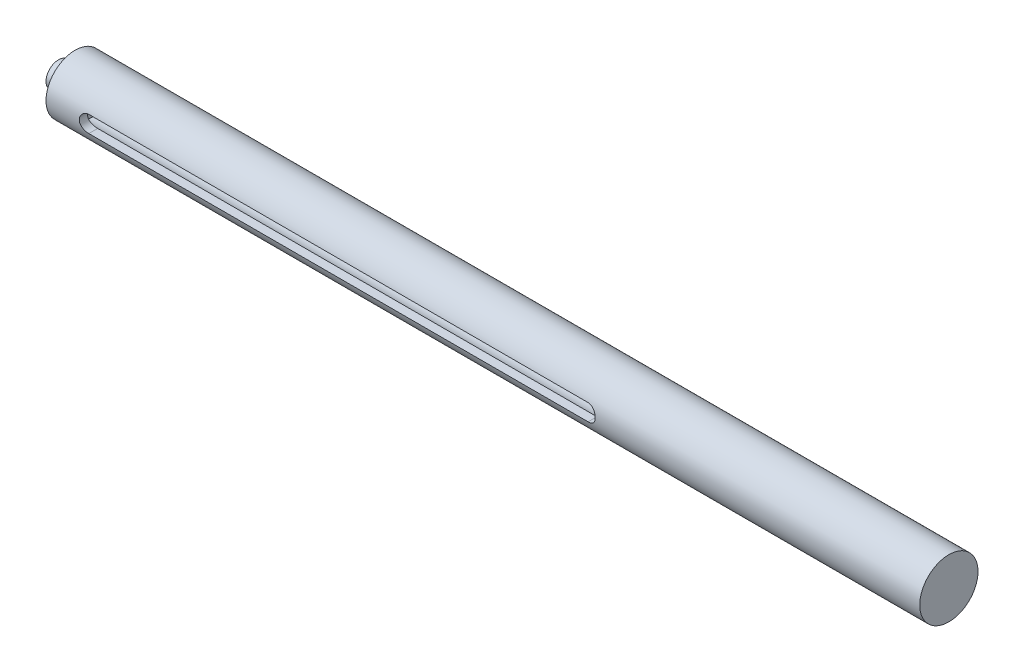
ISO-10303-21;
HEADER;
FILE_DESCRIPTION(('STEP AP214'),'2;1');
FILE_NAME('part.step','',(''),(''),'','','');
FILE_SCHEMA(('AUTOMOTIVE_DESIGN { 1 0 10303 214 1 1 1 1 }'));
ENDSEC;
DATA;
#1=APPLICATION_CONTEXT('core data for automotive mechanical design processes');
#2=APPLICATION_PROTOCOL_DEFINITION('international standard','automotive_design',2000,#1);
#3=PRODUCT_CONTEXT('',#1,'mechanical');
#4=PRODUCT('Part','Part','',(#3));
#5=PRODUCT_RELATED_PRODUCT_CATEGORY('part','',(#4));
#6=PRODUCT_DEFINITION_FORMATION('','',#4);
#7=PRODUCT_DEFINITION_CONTEXT('part definition',#1,'design');
#8=PRODUCT_DEFINITION('design','',#6,#7);
#9=PRODUCT_DEFINITION_SHAPE('','',#8);
#10=(LENGTH_UNIT() NAMED_UNIT(*) SI_UNIT(.MILLI.,.METRE.));
#11=(NAMED_UNIT(*) PLANE_ANGLE_UNIT() SI_UNIT($,.RADIAN.));
#12=(NAMED_UNIT(*) SI_UNIT($,.STERADIAN.) SOLID_ANGLE_UNIT());
#13=UNCERTAINTY_MEASURE_WITH_UNIT(LENGTH_MEASURE(1.E-05),#10,'distance_accuracy_value','');
#14=(GEOMETRIC_REPRESENTATION_CONTEXT(3) GLOBAL_UNCERTAINTY_ASSIGNED_CONTEXT((#13)) GLOBAL_UNIT_ASSIGNED_CONTEXT((#10,
#11,#12)) REPRESENTATION_CONTEXT('',''));
#15=CARTESIAN_POINT('',(0.,0.,0.));
#16=DIRECTION('',(0.,0.,1.));
#17=DIRECTION('',(1.,0.,0.));
#18=AXIS2_PLACEMENT_3D('',#15,#16,#17);
#19=CARTESIAN_POINT('',(-40.,0.,0.));
#20=DIRECTION('',(1.,0.,0.));
#21=DIRECTION('',(0.,0.,-1.));
#22=AXIS2_PLACEMENT_3D('',#19,#20,#21);
#23=PLANE('',#22);
#24=CARTESIAN_POINT('',(-40.,0.,0.));
#25=DIRECTION('',(1.,0.,0.));
#26=DIRECTION('',(0.,0.,-1.));
#27=AXIS2_PLACEMENT_3D('',#24,#25,#26);
#28=CIRCLE('',#27,3.5);
#29=CARTESIAN_POINT('',(-40.,0.,-3.5));
#30=VERTEX_POINT('',#29);
#31=EDGE_CURVE('E87',#30,#30,#28,.T.);
#32=ORIENTED_EDGE('',*,*,#31,.F.);
#33=EDGE_LOOP('',(#32));
#34=FACE_BOUND('',#33,.T.);
#35=CARTESIAN_POINT('',(-40.,0.,0.));
#36=DIRECTION('',(1.,0.,0.));
#37=DIRECTION('',(0.,0.,-1.));
#38=AXIS2_PLACEMENT_3D('',#35,#36,#37);
#39=CIRCLE('',#38,1.5);
#40=CARTESIAN_POINT('',(-40.,0.,-1.5));
#41=VERTEX_POINT('',#40);
#42=EDGE_CURVE('E27',#41,#41,#39,.F.);
#43=ORIENTED_EDGE('',*,*,#42,.F.);
#44=EDGE_LOOP('',(#43));
#45=FACE_BOUND('',#44,.T.);
#46=ADVANCED_FACE('F18',(#34,#45),#23,.F.);
#47=CARTESIAN_POINT('',(40.,0.,0.));
#48=DIRECTION('',(-1.,0.,0.));
#49=DIRECTION('',(0.,0.,1.));
#50=AXIS2_PLACEMENT_3D('',#47,#48,#49);
#51=CYLINDRICAL_SURFACE('',#50,3.5);
#52=ORIENTED_EDGE('',*,*,#31,.T.);
#53=EDGE_LOOP('',(#52));
#54=FACE_BOUND('',#53,.T.);
#55=CARTESIAN_POINT('',(25.,-1.,3.35410196624968));
#56=CARTESIAN_POINT('',(25.0275170249075,-1.00000049850503,3.35409976658492));
#57=CARTESIAN_POINT('',(25.0550202597348,-0.998863493287081,3.35444102034788));
#58=CARTESIAN_POINT('',(25.1098181033841,-0.994332009888001,3.35578786459359));
#59=CARTESIAN_POINT('',(25.1371127542802,-0.990937999820865,3.3567933173179));
#60=CARTESIAN_POINT('',(25.2182537496955,-0.977425314705552,3.36076375039943));
#61=CARTESIAN_POINT('',(25.2715378170372,-0.963975716618306,3.36468309657148));
#62=CARTESIAN_POINT('',(25.3749700144545,-0.928648815906224,3.37460265056326));
#63=CARTESIAN_POINT('',(25.4251189911293,-0.906773800005599,3.38060229373009));
#64=CARTESIAN_POINT('',(25.5210683200399,-0.855250482454159,3.39400252324997));
#65=CARTESIAN_POINT('',(25.5668668974157,-0.825599026596321,3.40140367773159));
#66=CARTESIAN_POINT('',(25.6540953815059,-0.758463189713919,3.41700871116802));
#67=CARTESIAN_POINT('',(25.6953820675198,-0.72079643428964,3.42522837538694));
#68=CARTESIAN_POINT('',(25.7711495263556,-0.639087782954267,3.44140944203543));
#69=CARTESIAN_POINT('',(25.8056291705064,-0.595044831905348,3.44937080145308));
#70=CARTESIAN_POINT('',(25.8674150706982,-0.500821950623903,3.46431682750159));
#71=CARTESIAN_POINT('',(25.8945760360545,-0.450543143150311,3.47128058280447));
#72=CARTESIAN_POINT('',(25.940001691248,-0.345901809951461,3.48326292773679));
#73=CARTESIAN_POINT('',(25.9582685086114,-0.291540264432993,3.48828198248995));
#74=CARTESIAN_POINT('',(25.9849170938375,-0.18177986422046,3.49569755735467));
#75=CARTESIAN_POINT('',(25.9935443291132,-0.126445076386653,3.49815908311015));
#76=CARTESIAN_POINT('',(26.0014433806286,-0.0150612429205636,3.50041048233729));
#77=CARTESIAN_POINT('',(26.0007167870587,0.0409876796872728,3.50020080992396));
#78=CARTESIAN_POINT('',(25.9900967865968,0.150490378802964,3.49718002611497));
#79=CARTESIAN_POINT('',(25.9804690968915,0.203972329131895,3.4944443251868));
#80=CARTESIAN_POINT('',(25.9527522573653,0.308526642102498,3.48676938053403));
#81=CARTESIAN_POINT('',(25.9346626803645,0.359598882951953,3.48183002556336));
#82=CARTESIAN_POINT('',(25.8903451327296,0.458537318553558,3.47019511125505));
#83=CARTESIAN_POINT('',(25.8640302352287,0.506362294335579,3.46348091788377));
#84=CARTESIAN_POINT('',(25.8040771088532,0.597004321590961,3.44901371958343));
#85=CARTESIAN_POINT('',(25.770437393581,0.639820353903323,3.44126050393247));
#86=CARTESIAN_POINT('',(25.695401201975,0.720812145758809,3.42522923719649));
#87=CARTESIAN_POINT('',(25.6537744565459,0.758773058684968,3.41694231453104));
#88=CARTESIAN_POINT('',(25.5646513518634,0.827240355260741,3.40101643089073));
#89=CARTESIAN_POINT('',(25.5171533336562,0.857744624720446,3.39337765408524));
#90=CARTESIAN_POINT('',(25.4171063869067,0.910632887034017,3.37957156162494));
#91=CARTESIAN_POINT('',(25.3645179481512,0.932945634858352,3.37341730876614));
#92=CARTESIAN_POINT('',(25.2561439679439,0.968311532076212,3.36343812734786));
#93=CARTESIAN_POINT('',(25.2003634116952,0.981378715751668,3.3596096696078));
#94=CARTESIAN_POINT('',(25.1200602690921,0.993060108315531,3.35616467475823));
#95=CARTESIAN_POINT('',(25.0961103225751,0.995662513879,3.35539270208153));
#96=CARTESIAN_POINT('',(25.0481108873562,0.999130770524189,3.35436137521794));
#97=CARTESIAN_POINT('',(25.0240616067922,0.999999270178643,3.35410123920007));
#98=CARTESIAN_POINT('',(25.,1.,3.35410196624968));
#99=B_SPLINE_CURVE_WITH_KNOTS('',3,(#55,#56,#57,#58,#59,#60,#61,#62,#63,#64,#65,#66,#67,#68,#69,
#70,#71,#72,#73,#74,#75,#76,#77,#78,#79,#80,#81,#82,#83,#84,#85,#86,#87,#88,#89,#90,#91,#92,#93,
#94,#95,#96,#97,#98),.UNSPECIFIED.,.F.,.F.,(4,2,2,2,2,2,2,2,2,2,2,2,2,2,2,2,2,2,2,2,2,4),(0.,
0.0824984357609059,0.164979766271595,0.329407523681618,0.493790685524924,0.658240626330376,
0.826933952896786,0.995655226942842,1.16751346138032,1.33933056621707,1.50666495361948,
1.67397089384628,1.83643825095359,1.99891381075498,2.16316806750177,2.32745568686297,
2.49749310251654,2.6675786732818,2.83911034045408,3.01038106966817,3.08263487199162,
3.15477822061624),.UNSPECIFIED.);
#100=CARTESIAN_POINT('',(25.,-1.,3.35410196624968));
#101=VERTEX_POINT('',#100);
#102=CARTESIAN_POINT('',(25.,1.,3.35410196624968));
#103=VERTEX_POINT('',#102);
#104=EDGE_CURVE('E90',#101,#103,#99,.T.);
#105=ORIENTED_EDGE('',*,*,#104,.F.);
#106=DIRECTION('',(-1.,0.,0.));
#107=VECTOR('',#106,1.);
#108=CARTESIAN_POINT('',(40.,-1.,3.35410196624968));
#109=LINE('',#108,#107);
#110=CARTESIAN_POINT('',(-35.,-1.,3.35410196624968));
#111=VERTEX_POINT('',#110);
#112=EDGE_CURVE('E148',#111,#101,#109,.F.);
#113=ORIENTED_EDGE('',*,*,#112,.F.);
#114=CARTESIAN_POINT('',(-35.,1.,3.35410196624968));
#115=CARTESIAN_POINT('',(-35.0275170249075,1.00000049850503,3.35409976658492));
#116=CARTESIAN_POINT('',(-35.0550202597348,0.998863493287082,3.35444102034788));
#117=CARTESIAN_POINT('',(-35.1098181033841,0.994332009888001,3.35578786459359));
#118=CARTESIAN_POINT('',(-35.1371127542802,0.990937999820865,3.3567933173179));
#119=CARTESIAN_POINT('',(-35.2182537496955,0.977425314705554,3.36076375039943));
#120=CARTESIAN_POINT('',(-35.2715378170372,0.963975716618308,3.36468309657148));
#121=CARTESIAN_POINT('',(-35.3749700144545,0.928648815906219,3.37460265056326));
#122=CARTESIAN_POINT('',(-35.4251189911293,0.906773800005585,3.38060229373009));
#123=CARTESIAN_POINT('',(-35.52106832004,0.855250482454147,3.39400252324997));
#124=CARTESIAN_POINT('',(-35.5668668974158,0.825599026596321,3.40140367773159));
#125=CARTESIAN_POINT('',(-35.6540953815059,0.75846318971392,3.41700871116802));
#126=CARTESIAN_POINT('',(-35.6953820675198,0.720796434289633,3.42522837538694));
#127=CARTESIAN_POINT('',(-35.7711495263556,0.639087782954258,3.44140944203543));
#128=CARTESIAN_POINT('',(-35.8056291705064,0.595044831905346,3.44937080145308));
#129=CARTESIAN_POINT('',(-35.8674150706982,0.500821950623907,3.46431682750159));
#130=CARTESIAN_POINT('',(-35.8945760360545,0.450543143150314,3.47128058280446));
#131=CARTESIAN_POINT('',(-35.940001691248,0.345901809951462,3.48326292773679));
#132=CARTESIAN_POINT('',(-35.9582685086114,0.291540264432993,3.48828198248995));
#133=CARTESIAN_POINT('',(-35.9849170938375,0.181779864220459,3.49569755735467));
#134=CARTESIAN_POINT('',(-35.9935443291132,0.126445076386652,3.49815908311015));
#135=CARTESIAN_POINT('',(-36.0014433806286,0.0150612429205627,3.50041048233729));
#136=CARTESIAN_POINT('',(-36.0007167870587,-0.0409876796872739,3.50020080992396));
#137=CARTESIAN_POINT('',(-35.9900967865968,-0.150490378802965,3.49718002611497));
#138=CARTESIAN_POINT('',(-35.9804690968915,-0.203972329131895,3.4944443251868));
#139=CARTESIAN_POINT('',(-35.9527522573653,-0.308526642102499,3.48676938053403));
#140=CARTESIAN_POINT('',(-35.9346626803645,-0.359598882951955,3.48183002556336));
#141=CARTESIAN_POINT('',(-35.8903451327296,-0.458537318553552,3.47019511125505));
#142=CARTESIAN_POINT('',(-35.8640302352286,-0.506362294335566,3.46348091788377));
#143=CARTESIAN_POINT('',(-35.8040771088533,-0.597004321590951,3.44901371958344));
#144=CARTESIAN_POINT('',(-35.7704373935811,-0.639820353903326,3.44126050393247));
#145=CARTESIAN_POINT('',(-35.695401201975,-0.720812145758812,3.42522923719649));
#146=CARTESIAN_POINT('',(-35.6537744565459,-0.758773058684957,3.41694231453104));
#147=CARTESIAN_POINT('',(-35.5646513518634,-0.827240355260727,3.40101643089074));
#148=CARTESIAN_POINT('',(-35.5171533336562,-0.857744624720442,3.39337765408524));
#149=CARTESIAN_POINT('',(-35.4171063869067,-0.910632887034021,3.37957156162494));
#150=CARTESIAN_POINT('',(-35.3645179481512,-0.932945634858353,3.37341730876614));
#151=CARTESIAN_POINT('',(-35.2561439679439,-0.968311532076213,3.36343812734786));
#152=CARTESIAN_POINT('',(-35.2003634116952,-0.981378715751669,3.3596096696078));
#153=CARTESIAN_POINT('',(-35.1200602690921,-0.993060108315532,3.35616467475823));
#154=CARTESIAN_POINT('',(-35.0961103225751,-0.995662513879001,3.35539270208153));
#155=CARTESIAN_POINT('',(-35.0481108873562,-0.999130770524188,3.35436137521794));
#156=CARTESIAN_POINT('',(-35.0240616067922,-0.999999270178643,3.35410123920007));
#157=CARTESIAN_POINT('',(-35.,-1.,3.35410196624968));
#158=B_SPLINE_CURVE_WITH_KNOTS('',3,(#114,#115,#116,#117,#118,#119,#120,#121,#122,#123,#124,
#125,#126,#127,#128,#129,#130,#131,#132,#133,#134,#135,#136,#137,#138,#139,#140,#141,#142,#143,
#144,#145,#146,#147,#148,#149,#150,#151,#152,#153,#154,#155,#156,#157),.UNSPECIFIED.,.F.,.F.,(4,
2,2,2,2,2,2,2,2,2,2,2,2,2,2,2,2,2,2,2,2,4),(0.,0.0824984357609093,0.164979766271588,
0.329407523681618,0.493790685524952,0.658240626330415,0.826933952896799,0.99565522694284,
1.16751346138032,1.33933056621707,1.50666495361948,1.67397089384628,1.8364382509536,
1.99891381075499,2.16316806750176,2.32745568686294,2.49749310251653,2.66757867328181,
2.83911034045409,3.01038106966818,3.08263487199164,3.15477822061625),.UNSPECIFIED.);
#159=CARTESIAN_POINT('',(-35.,1.,3.35410196624968));
#160=VERTEX_POINT('',#159);
#161=EDGE_CURVE('E96',#160,#111,#158,.T.);
#162=ORIENTED_EDGE('',*,*,#161,.F.);
#163=DIRECTION('',(-1.,0.,0.));
#164=VECTOR('',#163,1.);
#165=CARTESIAN_POINT('',(40.,1.,3.35410196624968));
#166=LINE('',#165,#164);
#167=EDGE_CURVE('E75',#103,#160,#166,.T.);
#168=ORIENTED_EDGE('',*,*,#167,.F.);
#169=EDGE_LOOP('',(#105,#113,#162,#168));
#170=FACE_BOUND('',#169,.T.);
#171=CARTESIAN_POINT('',(65.,0.,0.));
#172=DIRECTION('',(1.,0.,0.));
#173=DIRECTION('',(0.,0.,-1.));
#174=AXIS2_PLACEMENT_3D('',#171,#172,#173);
#175=CIRCLE('',#174,3.5);
#176=CARTESIAN_POINT('',(65.,0.,-3.5));
#177=VERTEX_POINT('',#176);
#178=EDGE_CURVE('E70',#177,#177,#175,.T.);
#179=ORIENTED_EDGE('',*,*,#178,.F.);
#180=EDGE_LOOP('',(#179));
#181=FACE_BOUND('',#180,.T.);
#182=ADVANCED_FACE('F20',(#54,#170,#181),#51,.T.);
#183=CARTESIAN_POINT('',(-35.,0.,3.5));
#184=DIRECTION('',(0.,0.,-1.));
#185=DIRECTION('',(-1.,0.,0.));
#186=AXIS2_PLACEMENT_3D('',#183,#184,#185);
#187=CYLINDRICAL_SURFACE('',#186,1.);
#188=CARTESIAN_POINT('',(-35.,1.,2.29128784747792));
#189=CARTESIAN_POINT('',(-35.0269103840027,1.00000116386643,2.29128430939571));
#190=CARTESIAN_POINT('',(-35.0538065609444,0.998913043941582,2.29176252371932));
#191=CARTESIAN_POINT('',(-35.1073819223814,0.994580942217761,2.29364713413326));
#192=CARTESIAN_POINT('',(-35.1340611856053,0.991337781507211,2.29505317671192));
#193=CARTESIAN_POINT('',(-35.2132675610055,0.978449878798021,2.30059288924686));
#194=CARTESIAN_POINT('',(-35.2652248346111,0.965646201662909,2.30604882507105));
#195=CARTESIAN_POINT('',(-35.3660084567948,0.932127367996509,2.31979763689074));
#196=CARTESIAN_POINT('',(-35.4148379987117,0.91142043585267,2.32808756281048));
#197=CARTESIAN_POINT('',(-35.5083868962999,0.862742971325663,2.34656153650137));
#198=CARTESIAN_POINT('',(-35.5531022895601,0.834765533722777,2.35674738231355));
#199=CARTESIAN_POINT('',(-35.639634338551,0.770658598314694,2.37850508848236));
#200=CARTESIAN_POINT('',(-35.6811844510361,0.734184414240038,2.39012125272111));
#201=CARTESIAN_POINT('',(-35.7577692933566,0.654848386636597,2.41306392819471));
#202=CARTESIAN_POINT('',(-35.792802685594,0.611985234976875,2.42439037955359));
#203=CARTESIAN_POINT('',(-35.856703436018,0.519002909887977,2.44601709248996));
#204=CARTESIAN_POINT('',(-35.8852724685305,0.468663954715679,2.45625912457899));
#205=CARTESIAN_POINT('',(-35.9334219724715,0.363412083428239,2.47401971876446));
#206=CARTESIAN_POINT('',(-35.9530061953086,0.30850108760279,2.48153941723396));
#207=CARTESIAN_POINT('',(-35.9816706165632,0.19848371770778,2.49269157373246));
#208=CARTESIAN_POINT('',(-35.9912134797064,0.143515526475389,2.49649461286354));
#209=CARTESIAN_POINT('',(-36.0010142357207,0.0326342160141269,2.50040155088157));
#210=CARTESIAN_POINT('',(-36.001275417903,-0.0232785614371597,2.50050676023285));
#211=CARTESIAN_POINT('',(-35.9927585814665,-0.1311166883068,2.49710980025699));
#212=CARTESIAN_POINT('',(-35.9844874769435,-0.183089601305246,2.49380992793548));
#213=CARTESIAN_POINT('',(-35.9600032861927,-0.284837393198609,2.48424635219906));
#214=CARTESIAN_POINT('',(-35.94378975049,-0.334612147522428,2.47798248104744));
#215=CARTESIAN_POINT('',(-35.9036818518646,-0.431448769549348,2.46298415299617));
#216=CARTESIAN_POINT('',(-35.8796753796154,-0.478458425687026,2.45421387377984));
#217=CARTESIAN_POINT('',(-35.8247677056818,-0.567903734595059,2.43507301003961));
#218=CARTESIAN_POINT('',(-35.793864085149,-0.610337774922437,2.42470186448207));
#219=CARTESIAN_POINT('',(-35.7236779098768,-0.692381696369259,2.40260891373089));
#220=CARTESIAN_POINT('',(-35.6839787626666,-0.731623851544995,2.39084313586447));
#221=CARTESIAN_POINT('',(-35.5985099524245,-0.803049630497082,2.3678097529232));
#222=CARTESIAN_POINT('',(-35.5527375389524,-0.835230038544943,2.3565423766639));
#223=CARTESIAN_POINT('',(-35.4547648579898,-0.89246828966811,2.33547844428013));
#224=CARTESIAN_POINT('',(-35.40241758167,-0.917294661088132,2.32573351075292));
#225=CARTESIAN_POINT('',(-35.2938192377852,-0.957606491786299,2.30943052529791));
#226=CARTESIAN_POINT('',(-35.2375752763308,-0.973108480011036,2.30286683814369));
#227=CARTESIAN_POINT('',(-35.150628182921,-0.989052909128603,2.29604151764747));
#228=CARTESIAN_POINT('',(-35.1206712253493,-0.993152525829897,2.29426718840263));
#229=CARTESIAN_POINT('',(-35.0604824905022,-0.998626410519056,2.29188770157194));
#230=CARTESIAN_POINT('',(-35.0302508941211,-1.00000235784284,2.29128182355872));
#231=CARTESIAN_POINT('',(-35.,-1.,2.29128784747792));
#232=B_SPLINE_CURVE_WITH_KNOTS('',3,(#188,#189,#190,#191,#192,#193,#194,#195,#196,#197,#198,
#199,#200,#201,#202,#203,#204,#205,#206,#207,#208,#209,#210,#211,#212,#213,#214,#215,#216,#217,
#218,#219,#220,#221,#222,#223,#224,#225,#226,#227,#228,#229,#230,#231),.UNSPECIFIED.,.F.,.F.,(4,
2,2,2,2,2,2,2,2,2,2,2,2,2,2,2,2,2,2,2,2,4),(0.,0.0806774265494227,0.161324131941622,
0.32184353760246,0.482196354925837,0.64270202876941,0.811445094033768,0.98022275675223,
1.15566914868509,1.33104222004289,1.49792423657763,1.66474711162956,1.82219943035396,
1.97966066058455,2.13949573869401,2.29938695972136,2.46976422743204,2.64021892007596,
2.81557606179859,2.99062143201691,3.08135581684535,3.17203424002409),.UNSPECIFIED.);
#233=CARTESIAN_POINT('',(-35.,1.,2.29128784747792));
#234=VERTEX_POINT('',#233);
#235=CARTESIAN_POINT('',(-35.,-1.,2.29128784747792));
#236=VERTEX_POINT('',#235);
#237=EDGE_CURVE('E60',#234,#236,#232,.T.);
#238=ORIENTED_EDGE('',*,*,#237,.F.);
#239=DIRECTION('',(0.,0.,-1.));
#240=VECTOR('',#239,1.);
#241=CARTESIAN_POINT('',(-35.,1.,3.5));
#242=LINE('',#241,#240);
#243=EDGE_CURVE('E67',#160,#234,#242,.T.);
#244=ORIENTED_EDGE('',*,*,#243,.F.);
#245=ORIENTED_EDGE('',*,*,#161,.T.);
#246=DIRECTION('',(0.,0.,-1.));
#247=VECTOR('',#246,1.);
#248=CARTESIAN_POINT('',(-35.,-1.,3.5));
#249=LINE('',#248,#247);
#250=EDGE_CURVE('E69',#111,#236,#249,.T.);
#251=ORIENTED_EDGE('',*,*,#250,.T.);
#252=EDGE_LOOP('',(#238,#244,#245,#251));
#253=FACE_BOUND('',#252,.T.);
#254=ADVANCED_FACE('F66',(#253),#187,.F.);
#255=CARTESIAN_POINT('',(-35.,-1.,3.5));
#256=DIRECTION('',(0.,1.,0.));
#257=DIRECTION('',(-1.,0.,0.));
#258=AXIS2_PLACEMENT_3D('',#255,#256,#257);
#259=PLANE('',#258);
#260=DIRECTION('',(1.,0.,0.));
#261=VECTOR('',#260,1.);
#262=CARTESIAN_POINT('',(-47.0710678118655,-1.,2.29128784747792));
#263=LINE('',#262,#261);
#264=CARTESIAN_POINT('',(25.,-1.,2.29128784747792));
#265=VERTEX_POINT('',#264);
#266=EDGE_CURVE('E71',#236,#265,#263,.T.);
#267=ORIENTED_EDGE('',*,*,#266,.F.);
#268=ORIENTED_EDGE('',*,*,#250,.F.);
#269=ORIENTED_EDGE('',*,*,#112,.T.);
#270=DIRECTION('',(0.,0.,-1.));
#271=VECTOR('',#270,1.);
#272=CARTESIAN_POINT('',(25.,-1.,3.5));
#273=LINE('',#272,#271);
#274=EDGE_CURVE('E78',#101,#265,#273,.T.);
#275=ORIENTED_EDGE('',*,*,#274,.T.);
#276=EDGE_LOOP('',(#267,#268,#269,#275));
#277=FACE_BOUND('',#276,.T.);
#278=ADVANCED_FACE('F107',(#277),#259,.T.);
#279=CARTESIAN_POINT('',(25.,0.,3.5));
#280=DIRECTION('',(0.,0.,-1.));
#281=DIRECTION('',(-1.,0.,0.));
#282=AXIS2_PLACEMENT_3D('',#279,#280,#281);
#283=CYLINDRICAL_SURFACE('',#282,1.);
#284=CARTESIAN_POINT('',(25.,-1.,2.29128784747792));
#285=CARTESIAN_POINT('',(25.0269103840027,-1.00000116386643,2.29128430939571));
#286=CARTESIAN_POINT('',(25.0538065609444,-0.998913043941582,2.29176252371932));
#287=CARTESIAN_POINT('',(25.1073819223814,-0.994580942217764,2.29364713413326));
#288=CARTESIAN_POINT('',(25.1340611856052,-0.991337781507216,2.29505317671192));
#289=CARTESIAN_POINT('',(25.2132675610054,-0.978449878798026,2.30059288924686));
#290=CARTESIAN_POINT('',(25.2652248346111,-0.965646201662906,2.30604882507105));
#291=CARTESIAN_POINT('',(25.3660084567947,-0.932127367996508,2.31979763689074));
#292=CARTESIAN_POINT('',(25.4148379987117,-0.911420435852677,2.32808756281048));
#293=CARTESIAN_POINT('',(25.5083868962999,-0.862742971325673,2.34656153650137));
#294=CARTESIAN_POINT('',(25.5531022895601,-0.834765533722784,2.35674738231355));
#295=CARTESIAN_POINT('',(25.639634338551,-0.770658598314696,2.37850508848236));
#296=CARTESIAN_POINT('',(25.6811844510361,-0.73418441424004,2.39012125272111));
#297=CARTESIAN_POINT('',(25.7577692933566,-0.654848386636598,2.41306392819471));
#298=CARTESIAN_POINT('',(25.792802685594,-0.611985234976875,2.42439037955359));
#299=CARTESIAN_POINT('',(25.856703436018,-0.519002909887977,2.44601709248996));
#300=CARTESIAN_POINT('',(25.8852724685305,-0.468663954715677,2.45625912457899));
#301=CARTESIAN_POINT('',(25.9334219724715,-0.363412083428237,2.47401971876446));
#302=CARTESIAN_POINT('',(25.9530061953086,-0.308501087602788,2.48153941723396));
#303=CARTESIAN_POINT('',(25.9816706165632,-0.198483717707779,2.49269157373246));
#304=CARTESIAN_POINT('',(25.9912134797064,-0.143515526475389,2.49649461286354));
#305=CARTESIAN_POINT('',(26.0010142357207,-0.0326342160141267,2.50040155088157));
#306=CARTESIAN_POINT('',(26.001275417903,0.0232785614371597,2.50050676023285));
#307=CARTESIAN_POINT('',(25.9927585814666,0.1311166883068,2.49710980025699));
#308=CARTESIAN_POINT('',(25.9844874769436,0.183089601305246,2.49380992793548));
#309=CARTESIAN_POINT('',(25.9600032861927,0.284837393198608,2.48424635219906));
#310=CARTESIAN_POINT('',(25.94378975049,0.334612147522426,2.47798248104744));
#311=CARTESIAN_POINT('',(25.9036818518646,0.431448769549353,2.46298415299616));
#312=CARTESIAN_POINT('',(25.8796753796154,0.478458425687039,2.45421387377984));
#313=CARTESIAN_POINT('',(25.8247677056818,0.567903734595067,2.43507301003961));
#314=CARTESIAN_POINT('',(25.793864085149,0.610337774922431,2.42470186448208));
#315=CARTESIAN_POINT('',(25.7236779098768,0.692381696369253,2.40260891373089));
#316=CARTESIAN_POINT('',(25.6839787626666,0.731623851545005,2.39084313586447));
#317=CARTESIAN_POINT('',(25.5985099524245,0.803049630497096,2.3678097529232));
#318=CARTESIAN_POINT('',(25.5527375389524,0.835230038544947,2.3565423766639));
#319=CARTESIAN_POINT('',(25.4547648579898,0.892468289668106,2.33547844428014));
#320=CARTESIAN_POINT('',(25.40241758167,0.917294661088129,2.32573351075292));
#321=CARTESIAN_POINT('',(25.2938192377852,0.957606491786299,2.30943052529791));
#322=CARTESIAN_POINT('',(25.2375752763308,0.973108480011036,2.30286683814369));
#323=CARTESIAN_POINT('',(25.150628182921,0.989052909128603,2.29604151764747));
#324=CARTESIAN_POINT('',(25.1206712253493,0.993152525829897,2.29426718840263));
#325=CARTESIAN_POINT('',(25.0604824905022,0.998626410519057,2.29188770157194));
#326=CARTESIAN_POINT('',(25.0302508941211,1.00000235784284,2.29128182355872));
#327=CARTESIAN_POINT('',(25.,1.,2.29128784747792));
#328=B_SPLINE_CURVE_WITH_KNOTS('',3,(#284,#285,#286,#287,#288,#289,#290,#291,#292,#293,#294,
#295,#296,#297,#298,#299,#300,#301,#302,#303,#304,#305,#306,#307,#308,#309,#310,#311,#312,#313,
#314,#315,#316,#317,#318,#319,#320,#321,#322,#323,#324,#325,#326,#327),.UNSPECIFIED.,.F.,.F.,(4,
2,2,2,2,2,2,2,2,2,2,2,2,2,2,2,2,2,2,2,2,4),(0.,0.0806774265494018,0.161324131941586,
0.321843537602416,0.482196354925818,0.642702028769406,0.811445094033764,0.980222756752228,
1.1556691486851,1.33104222004289,1.49792423657763,1.66474711162956,1.82219943035396,
1.97966066058455,2.13949573869402,2.29938695972139,2.46976422743206,2.64021892007595,
2.81557606179858,2.9906214320169,3.08135581684534,3.17203424002408),.UNSPECIFIED.);
#329=CARTESIAN_POINT('',(25.,1.,2.29128784747792));
#330=VERTEX_POINT('',#329);
#331=EDGE_CURVE('E33',#265,#330,#328,.T.);
#332=ORIENTED_EDGE('',*,*,#331,.F.);
#333=ORIENTED_EDGE('',*,*,#274,.F.);
#334=ORIENTED_EDGE('',*,*,#104,.T.);
#335=DIRECTION('',(0.,0.,-1.));
#336=VECTOR('',#335,1.);
#337=CARTESIAN_POINT('',(25.,1.,3.5));
#338=LINE('',#337,#336);
#339=EDGE_CURVE('E40',#103,#330,#338,.T.);
#340=ORIENTED_EDGE('',*,*,#339,.T.);
#341=EDGE_LOOP('',(#332,#333,#334,#340));
#342=FACE_BOUND('',#341,.T.);
#343=ADVANCED_FACE('F102',(#342),#283,.F.);
#344=CARTESIAN_POINT('',(-35.,1.,3.5));
#345=DIRECTION('',(0.,-1.,0.));
#346=DIRECTION('',(0.,0.,-1.));
#347=AXIS2_PLACEMENT_3D('',#344,#345,#346);
#348=PLANE('',#347);
#349=DIRECTION('',(1.,0.,0.));
#350=VECTOR('',#349,1.);
#351=CARTESIAN_POINT('',(-47.0710678118655,1.,2.29128784747792));
#352=LINE('',#351,#350);
#353=EDGE_CURVE('E12',#330,#234,#352,.F.);
#354=ORIENTED_EDGE('',*,*,#353,.F.);
#355=ORIENTED_EDGE('',*,*,#339,.F.);
#356=ORIENTED_EDGE('',*,*,#167,.T.);
#357=ORIENTED_EDGE('',*,*,#243,.T.);
#358=EDGE_LOOP('',(#354,#355,#356,#357));
#359=FACE_BOUND('',#358,.T.);
#360=ADVANCED_FACE('F73',(#359),#348,.T.);
#361=CARTESIAN_POINT('',(-42.,0.,0.));
#362=DIRECTION('',(1.,0.,0.));
#363=DIRECTION('',(0.,0.,-1.));
#364=AXIS2_PLACEMENT_3D('',#361,#362,#363);
#365=CYLINDRICAL_SURFACE('',#364,1.5);
#366=CARTESIAN_POINT('',(-42.,0.,0.));
#367=DIRECTION('',(-1.,0.,0.));
#368=DIRECTION('',(0.,0.,1.));
#369=AXIS2_PLACEMENT_3D('',#366,#367,#368);
#370=CIRCLE('',#369,1.5);
#371=CARTESIAN_POINT('',(-42.,0.,1.5));
#372=VERTEX_POINT('',#371);
#373=EDGE_CURVE('E76',#372,#372,#370,.T.);
#374=ORIENTED_EDGE('',*,*,#373,.F.);
#375=EDGE_LOOP('',(#374));
#376=FACE_BOUND('',#375,.T.);
#377=ORIENTED_EDGE('',*,*,#42,.T.);
#378=EDGE_LOOP('',(#377));
#379=FACE_BOUND('',#378,.T.);
#380=ADVANCED_FACE('F165',(#376,#379),#365,.T.);
#381=CARTESIAN_POINT('',(-42.,0.,0.));
#382=DIRECTION('',(-1.,0.,0.));
#383=DIRECTION('',(0.,0.,1.));
#384=AXIS2_PLACEMENT_3D('',#381,#382,#383);
#385=PLANE('',#384);
#386=ORIENTED_EDGE('',*,*,#373,.T.);
#387=EDGE_LOOP('',(#386));
#388=FACE_BOUND('',#387,.T.);
#389=ADVANCED_FACE('F160',(#388),#385,.T.);
#390=CARTESIAN_POINT('',(65.,0.,0.));
#391=DIRECTION('',(1.,0.,0.));
#392=DIRECTION('',(0.,0.,-1.));
#393=AXIS2_PLACEMENT_3D('',#390,#391,#392);
#394=PLANE('',#393);
#395=ORIENTED_EDGE('',*,*,#178,.T.);
#396=EDGE_LOOP('',(#395));
#397=FACE_BOUND('',#396,.T.);
#398=ADVANCED_FACE('F125',(#397),#394,.T.);
#399=CARTESIAN_POINT('',(-47.0710678118655,0.,0.));
#400=DIRECTION('',(1.,0.,0.));
#401=DIRECTION('',(0.,0.,-1.));
#402=AXIS2_PLACEMENT_3D('',#399,#400,#401);
#403=CYLINDRICAL_SURFACE('',#402,2.5);
#404=ORIENTED_EDGE('',*,*,#237,.T.);
#405=ORIENTED_EDGE('',*,*,#266,.T.);
#406=ORIENTED_EDGE('',*,*,#331,.T.);
#407=ORIENTED_EDGE('',*,*,#353,.T.);
#408=EDGE_LOOP('',(#404,#405,#406,#407));
#409=FACE_BOUND('',#408,.T.);
#410=CARTESIAN_POINT('',(-38.,0.,0.));
#411=DIRECTION('',(1.,0.,0.));
#412=DIRECTION('',(0.,0.,-1.));
#413=AXIS2_PLACEMENT_3D('',#410,#411,#412);
#414=CIRCLE('',#413,2.5);
#415=CARTESIAN_POINT('',(-38.,0.,-2.5));
#416=VERTEX_POINT('',#415);
#417=EDGE_CURVE('E118',#416,#416,#414,.F.);
#418=ORIENTED_EDGE('',*,*,#417,.T.);
#419=EDGE_LOOP('',(#418));
#420=FACE_BOUND('',#419,.T.);
#421=CARTESIAN_POINT('',(63.,0.,0.));
#422=DIRECTION('',(1.,0.,0.));
#423=DIRECTION('',(0.,0.,-1.));
#424=AXIS2_PLACEMENT_3D('',#421,#422,#423);
#425=CIRCLE('',#424,2.5);
#426=CARTESIAN_POINT('',(63.,0.,-2.5));
#427=VERTEX_POINT('',#426);
#428=EDGE_CURVE('E251',#427,#427,#425,.T.);
#429=ORIENTED_EDGE('',*,*,#428,.T.);
#430=EDGE_LOOP('',(#429));
#431=FACE_BOUND('',#430,.T.);
#432=ADVANCED_FACE('F58',(#409,#420,#431),#403,.F.);
#433=CARTESIAN_POINT('',(-38.,0.,0.));
#434=DIRECTION('',(1.,0.,0.));
#435=DIRECTION('',(0.,0.,-1.));
#436=AXIS2_PLACEMENT_3D('',#433,#434,#435);
#437=PLANE('',#436);
#438=ORIENTED_EDGE('',*,*,#417,.F.);
#439=EDGE_LOOP('',(#438));
#440=FACE_BOUND('',#439,.T.);
#441=ADVANCED_FACE('F124',(#440),#437,.T.);
#442=CARTESIAN_POINT('',(63.,0.,0.));
#443=DIRECTION('',(1.,0.,0.));
#444=DIRECTION('',(0.,0.,-1.));
#445=AXIS2_PLACEMENT_3D('',#442,#443,#444);
#446=PLANE('',#445);
#447=ORIENTED_EDGE('',*,*,#428,.F.);
#448=EDGE_LOOP('',(#447));
#449=FACE_BOUND('',#448,.T.);
#450=ADVANCED_FACE('F235',(#449),#446,.F.);
#451=CLOSED_SHELL('',(#46,#182,#254,#278,#343,#360,#380,#389,#398,#432,#441,#450));
#452=MANIFOLD_SOLID_BREP('B1',#451);
#453=ADVANCED_BREP_SHAPE_REPRESENTATION('',(#18,#452),#14);
#454=SHAPE_DEFINITION_REPRESENTATION(#9,#453);
ENDSEC;
END-ISO-10303-21;
